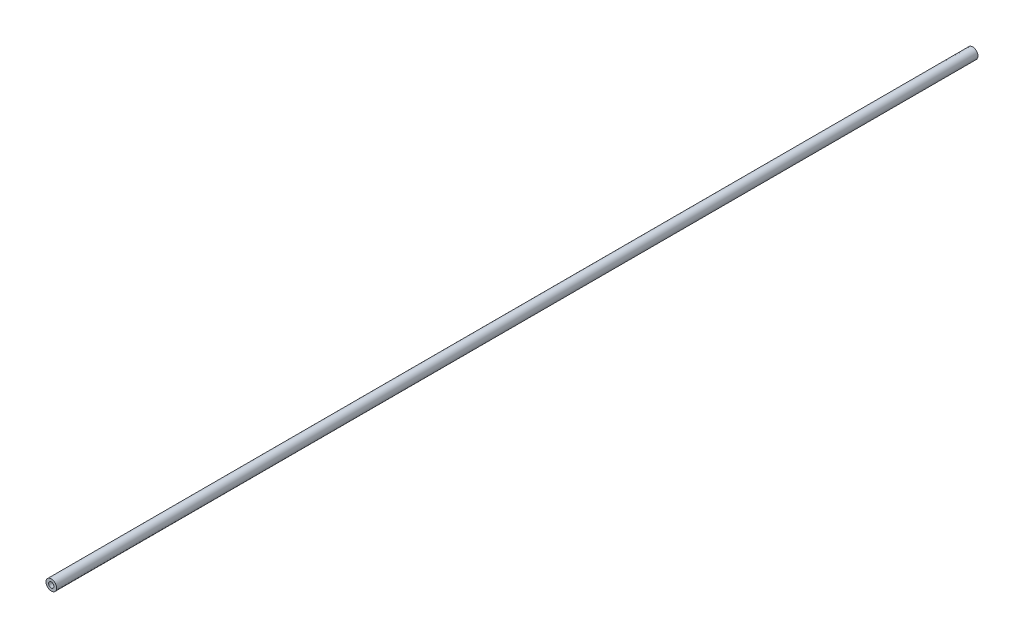
ISO-10303-21;
HEADER;
FILE_DESCRIPTION(('STEP AP214'),'2;1');
FILE_NAME('part.step','',(''),(''),'','','');
FILE_SCHEMA(('AUTOMOTIVE_DESIGN { 1 0 10303 214 1 1 1 1 }'));
ENDSEC;
DATA;
#1=APPLICATION_CONTEXT('core data for automotive mechanical design processes');
#2=APPLICATION_PROTOCOL_DEFINITION('international standard','automotive_design',2000,#1);
#3=PRODUCT_CONTEXT('',#1,'mechanical');
#4=PRODUCT('Part','Part','',(#3));
#5=PRODUCT_RELATED_PRODUCT_CATEGORY('part','',(#4));
#6=PRODUCT_DEFINITION_FORMATION('','',#4);
#7=PRODUCT_DEFINITION_CONTEXT('part definition',#1,'design');
#8=PRODUCT_DEFINITION('design','',#6,#7);
#9=PRODUCT_DEFINITION_SHAPE('','',#8);
#10=(LENGTH_UNIT() NAMED_UNIT(*) SI_UNIT(.MILLI.,.METRE.));
#11=(NAMED_UNIT(*) PLANE_ANGLE_UNIT() SI_UNIT($,.RADIAN.));
#12=(NAMED_UNIT(*) SI_UNIT($,.STERADIAN.) SOLID_ANGLE_UNIT());
#13=UNCERTAINTY_MEASURE_WITH_UNIT(LENGTH_MEASURE(1.E-05),#10,'distance_accuracy_value','');
#14=(GEOMETRIC_REPRESENTATION_CONTEXT(3) GLOBAL_UNCERTAINTY_ASSIGNED_CONTEXT((#13)) GLOBAL_UNIT_ASSIGNED_CONTEXT((#10,
#11,#12)) REPRESENTATION_CONTEXT('',''));
#15=CARTESIAN_POINT('',(0.,0.,0.));
#16=DIRECTION('',(0.,0.,1.));
#17=DIRECTION('',(1.,0.,0.));
#18=AXIS2_PLACEMENT_3D('',#15,#16,#17);
#19=CARTESIAN_POINT('',(0.,0.,441.96));
#20=DIRECTION('',(0.,0.,1.));
#21=DIRECTION('',(1.,0.,0.));
#22=AXIS2_PLACEMENT_3D('',#19,#20,#21);
#23=PLANE('',#22);
#24=CARTESIAN_POINT('',(0.,0.,441.96));
#25=DIRECTION('',(0.,0.,1.));
#26=DIRECTION('',(1.,0.,0.));
#27=AXIS2_PLACEMENT_3D('',#24,#25,#26);
#28=CIRCLE('',#27,2.54);
#29=CARTESIAN_POINT('',(2.54,0.,441.96));
#30=VERTEX_POINT('',#29);
#31=EDGE_CURVE('E10',#30,#30,#28,.T.);
#32=ORIENTED_EDGE('',*,*,#31,.T.);
#33=EDGE_LOOP('',(#32));
#34=FACE_BOUND('',#33,.T.);
#35=CARTESIAN_POINT('',(0.,0.,441.96));
#36=DIRECTION('',(0.,0.,1.));
#37=DIRECTION('',(1.,0.,0.));
#38=AXIS2_PLACEMENT_3D('',#35,#36,#37);
#39=CIRCLE('',#38,1.27);
#40=CARTESIAN_POINT('',(1.27,0.,441.96));
#41=VERTEX_POINT('',#40);
#42=EDGE_CURVE('E50',#41,#41,#39,.T.);
#43=ORIENTED_EDGE('',*,*,#42,.F.);
#44=EDGE_LOOP('',(#43));
#45=FACE_BOUND('',#44,.T.);
#46=ADVANCED_FACE('F37',(#34,#45),#23,.T.);
#47=CARTESIAN_POINT('',(0.,0.,0.));
#48=DIRECTION('',(0.,0.,1.));
#49=DIRECTION('',(1.,0.,0.));
#50=AXIS2_PLACEMENT_3D('',#47,#48,#49);
#51=PLANE('',#50);
#52=CARTESIAN_POINT('',(0.,0.,0.));
#53=DIRECTION('',(0.,0.,1.));
#54=DIRECTION('',(1.,0.,0.));
#55=AXIS2_PLACEMENT_3D('',#52,#53,#54);
#56=CIRCLE('',#55,2.54);
#57=CARTESIAN_POINT('',(2.54,0.,0.));
#58=VERTEX_POINT('',#57);
#59=EDGE_CURVE('E41',#58,#58,#56,.T.);
#60=ORIENTED_EDGE('',*,*,#59,.F.);
#61=EDGE_LOOP('',(#60));
#62=FACE_BOUND('',#61,.T.);
#63=CARTESIAN_POINT('',(0.,0.,0.));
#64=DIRECTION('',(0.,0.,1.));
#65=DIRECTION('',(1.,0.,0.));
#66=AXIS2_PLACEMENT_3D('',#63,#64,#65);
#67=CIRCLE('',#66,1.27);
#68=CARTESIAN_POINT('',(1.27,0.,0.));
#69=VERTEX_POINT('',#68);
#70=EDGE_CURVE('E52',#69,#69,#67,.T.);
#71=ORIENTED_EDGE('',*,*,#70,.T.);
#72=EDGE_LOOP('',(#71));
#73=FACE_BOUND('',#72,.T.);
#74=ADVANCED_FACE('F64',(#62,#73),#51,.F.);
#75=CARTESIAN_POINT('',(0.,0.,441.96));
#76=DIRECTION('',(0.,0.,-1.));
#77=DIRECTION('',(-1.,0.,0.));
#78=AXIS2_PLACEMENT_3D('',#75,#76,#77);
#79=CYLINDRICAL_SURFACE('',#78,2.54);
#80=ORIENTED_EDGE('',*,*,#31,.F.);
#81=EDGE_LOOP('',(#80));
#82=FACE_BOUND('',#81,.T.);
#83=ORIENTED_EDGE('',*,*,#59,.T.);
#84=EDGE_LOOP('',(#83));
#85=FACE_BOUND('',#84,.T.);
#86=ADVANCED_FACE('F39',(#82,#85),#79,.T.);
#87=CARTESIAN_POINT('',(0.,0.,441.96));
#88=DIRECTION('',(0.,0.,-1.));
#89=DIRECTION('',(-1.,0.,0.));
#90=AXIS2_PLACEMENT_3D('',#87,#88,#89);
#91=CYLINDRICAL_SURFACE('',#90,1.27);
#92=ORIENTED_EDGE('',*,*,#42,.T.);
#93=EDGE_LOOP('',(#92));
#94=FACE_BOUND('',#93,.T.);
#95=ORIENTED_EDGE('',*,*,#70,.F.);
#96=EDGE_LOOP('',(#95));
#97=FACE_BOUND('',#96,.T.);
#98=ADVANCED_FACE('F60',(#94,#97),#91,.F.);
#99=CLOSED_SHELL('',(#46,#74,#86,#98));
#100=MANIFOLD_SOLID_BREP('B2',#99);
#101=ADVANCED_BREP_SHAPE_REPRESENTATION('',(#18,#100),#14);
#102=SHAPE_DEFINITION_REPRESENTATION(#9,#101);
ENDSEC;
END-ISO-10303-21;
